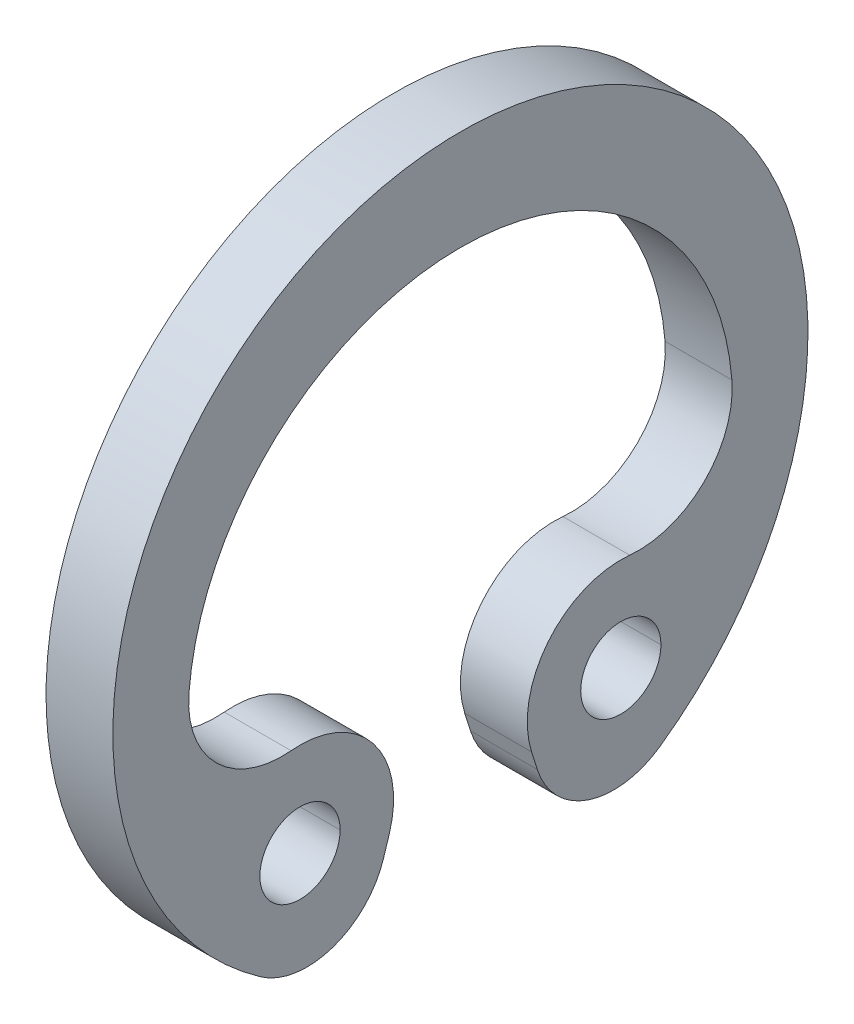
ISO-10303-21;
HEADER;
FILE_DESCRIPTION(('STEP AP214'),'2;1');
FILE_NAME('part.step','',(''),(''),'','','');
FILE_SCHEMA(('AUTOMOTIVE_DESIGN { 1 0 10303 214 1 1 1 1 }'));
ENDSEC;
DATA;
#1=APPLICATION_CONTEXT('core data for automotive mechanical design processes');
#2=APPLICATION_PROTOCOL_DEFINITION('international standard','automotive_design',2000,#1);
#3=PRODUCT_CONTEXT('',#1,'mechanical');
#4=PRODUCT('Part','Part','',(#3));
#5=PRODUCT_RELATED_PRODUCT_CATEGORY('part','',(#4));
#6=PRODUCT_DEFINITION_FORMATION('','',#4);
#7=PRODUCT_DEFINITION_CONTEXT('part definition',#1,'design');
#8=PRODUCT_DEFINITION('design','',#6,#7);
#9=PRODUCT_DEFINITION_SHAPE('','',#8);
#10=(LENGTH_UNIT() NAMED_UNIT(*) SI_UNIT(.MILLI.,.METRE.));
#11=(NAMED_UNIT(*) PLANE_ANGLE_UNIT() SI_UNIT($,.RADIAN.));
#12=(NAMED_UNIT(*) SI_UNIT($,.STERADIAN.) SOLID_ANGLE_UNIT());
#13=UNCERTAINTY_MEASURE_WITH_UNIT(LENGTH_MEASURE(1.E-05),#10,'distance_accuracy_value','');
#14=(GEOMETRIC_REPRESENTATION_CONTEXT(3) GLOBAL_UNCERTAINTY_ASSIGNED_CONTEXT((#13)) GLOBAL_UNIT_ASSIGNED_CONTEXT((#10,
#11,#12)) REPRESENTATION_CONTEXT('',''));
#15=CARTESIAN_POINT('',(0.,0.,0.));
#16=DIRECTION('',(0.,0.,1.));
#17=DIRECTION('',(1.,0.,0.));
#18=AXIS2_PLACEMENT_3D('',#15,#16,#17);
#19=CARTESIAN_POINT('',(0.5,-3.27636624130944,-2.29465122683329));
#20=DIRECTION('',(-1.,0.,0.));
#21=DIRECTION('',(0.,0.947082851566057,-0.320989208961151));
#22=AXIS2_PLACEMENT_3D('',#19,#20,#21);
#23=CYLINDRICAL_SURFACE('',#22,1.20000000000005);
#24=CARTESIAN_POINT('',(-0.5,-3.27636624130944,-2.29465122683329));
#25=DIRECTION('',(1.,0.,0.));
#26=DIRECTION('',(0.,0.,-1.));
#27=AXIS2_PLACEMENT_3D('',#24,#25,#26);
#28=CIRCLE('',#27,1.20000000000005);
#29=CARTESIAN_POINT('',(-0.5,-3.6381806072484,-1.150496357683));
#30=VERTEX_POINT('',#29);
#31=CARTESIAN_POINT('',(-0.5,-4.25927608667051,-2.98304663348009));
#32=VERTEX_POINT('',#31);
#33=EDGE_CURVE('E11',#30,#32,#28,.T.);
#34=ORIENTED_EDGE('',*,*,#33,.T.);
#35=DIRECTION('',(-1.,0.,0.));
#36=VECTOR('',#35,1.);
#37=CARTESIAN_POINT('',(0.5,-4.25927608667051,-2.98304663348009));
#38=LINE('',#37,#36);
#39=CARTESIAN_POINT('',(0.5,-4.25927608667051,-2.98304663348009));
#40=VERTEX_POINT('',#39);
#41=EDGE_CURVE('E25',#40,#32,#38,.T.);
#42=ORIENTED_EDGE('',*,*,#41,.F.);
#43=CARTESIAN_POINT('',(0.5,-3.27636624130944,-2.29465122683329));
#44=DIRECTION('',(1.,0.,0.));
#45=DIRECTION('',(0.,0.,-1.));
#46=AXIS2_PLACEMENT_3D('',#43,#44,#45);
#47=CIRCLE('',#46,1.20000000000005);
#48=CARTESIAN_POINT('',(0.5,-3.6381806072484,-1.150496357683));
#49=VERTEX_POINT('',#48);
#50=EDGE_CURVE('E301',#49,#40,#47,.T.);
#51=ORIENTED_EDGE('',*,*,#50,.F.);
#52=DIRECTION('',(-1.,0.,0.));
#53=VECTOR('',#52,1.);
#54=CARTESIAN_POINT('',(0.5,-3.6381806072484,-1.150496357683));
#55=LINE('',#54,#53);
#56=EDGE_CURVE('E297',#49,#30,#55,.T.);
#57=ORIENTED_EDGE('',*,*,#56,.T.);
#58=EDGE_LOOP('',(#34,#42,#51,#57));
#59=FACE_BOUND('',#58,.T.);
#60=ADVANCED_FACE('F17',(#59),#23,.T.);
#61=CARTESIAN_POINT('',(0.5,-3.3683007327933,-1.065152652658));
#62=DIRECTION('',(0.,0.301511971615848,-0.953462390958513));
#63=DIRECTION('',(0.,0.953462390958513,0.301511971615848));
#64=AXIS2_PLACEMENT_3D('',#61,#62,#63);
#65=PLANE('',#64);
#66=DIRECTION('',(0.,-0.953462390958513,-0.301511971615847));
#67=VECTOR('',#66,1.);
#68=CARTESIAN_POINT('',(-0.5,-3.3683007327933,-1.065152652658));
#69=LINE('',#68,#67);
#70=CARTESIAN_POINT('',(-0.5,-3.3683007327933,-1.065152652658));
#71=VERTEX_POINT('',#70);
#72=EDGE_CURVE('E292',#71,#30,#69,.T.);
#73=ORIENTED_EDGE('',*,*,#72,.T.);
#74=ORIENTED_EDGE('',*,*,#56,.F.);
#75=DIRECTION('',(0.,-0.953462390958513,-0.301511971615847));
#76=VECTOR('',#75,1.);
#77=CARTESIAN_POINT('',(0.5,-3.3683007327933,-1.065152652658));
#78=LINE('',#77,#76);
#79=CARTESIAN_POINT('',(0.5,-3.3683007327933,-1.065152652658));
#80=VERTEX_POINT('',#79);
#81=EDGE_CURVE('E287',#80,#49,#78,.T.);
#82=ORIENTED_EDGE('',*,*,#81,.F.);
#83=DIRECTION('',(-1.,0.,0.));
#84=VECTOR('',#83,1.);
#85=CARTESIAN_POINT('',(0.5,-3.3683007327933,-1.065152652658));
#86=LINE('',#85,#84);
#87=EDGE_CURVE('E283',#80,#71,#86,.T.);
#88=ORIENTED_EDGE('',*,*,#87,.T.);
#89=EDGE_LOOP('',(#73,#74,#82,#88));
#90=FACE_BOUND('',#89,.T.);
#91=ADVANCED_FACE('F318',(#90),#65,.F.);
#92=CARTESIAN_POINT('',(0.5,-2.94618397253134,-2.40000000000006));
#93=DIRECTION('',(-1.,0.,0.));
#94=DIRECTION('',(0.,-0.628697041238616,-0.777650326520738));
#95=AXIS2_PLACEMENT_3D('',#92,#93,#94);
#96=CYLINDRICAL_SURFACE('',#95,1.40000000000007);
#97=CARTESIAN_POINT('',(-0.5,-2.94618397253134,-2.40000000000006));
#98=DIRECTION('',(1.,0.,0.));
#99=DIRECTION('',(0.,0.,-1.));
#100=AXIS2_PLACEMENT_3D('',#97,#98,#99);
#101=CIRCLE('',#100,1.40000000000007);
#102=CARTESIAN_POINT('',(-0.5,-1.5525279459312,-2.5331273056939));
#103=VERTEX_POINT('',#102);
#104=EDGE_CURVE('E278',#103,#71,#101,.T.);
#105=ORIENTED_EDGE('',*,*,#104,.T.);
#106=ORIENTED_EDGE('',*,*,#87,.F.);
#107=CARTESIAN_POINT('',(0.5,-2.94618397253134,-2.40000000000006));
#108=DIRECTION('',(1.,0.,0.));
#109=DIRECTION('',(0.,0.,-1.));
#110=AXIS2_PLACEMENT_3D('',#107,#108,#109);
#111=CIRCLE('',#110,1.40000000000007);
#112=CARTESIAN_POINT('',(0.5,-1.5525279459312,-2.5331273056939));
#113=VERTEX_POINT('',#112);
#114=EDGE_CURVE('E273',#113,#80,#111,.T.);
#115=ORIENTED_EDGE('',*,*,#114,.F.);
#116=DIRECTION('',(-1.,0.,0.));
#117=VECTOR('',#116,1.);
#118=CARTESIAN_POINT('',(0.5,-1.5525279459312,-2.5331273056939));
#119=LINE('',#118,#117);
#120=EDGE_CURVE('E269',#113,#103,#119,.T.);
#121=ORIENTED_EDGE('',*,*,#120,.T.);
#122=EDGE_LOOP('',(#105,#106,#115,#121));
#123=FACE_BOUND('',#122,.T.);
#124=ADVANCED_FACE('F350',(#123),#96,.T.);
#125=CARTESIAN_POINT('',(0.5,-0.158871919331083,-2.66625461138772));
#126=DIRECTION('',(-1.,0.,0.));
#127=DIRECTION('',(0.,0.712162422773801,0.702014731746386));
#128=AXIS2_PLACEMENT_3D('',#125,#126,#127);
#129=CYLINDRICAL_SURFACE('',#128,1.40000000000004);
#130=CARTESIAN_POINT('',(-0.5,-0.158871919331083,-2.66625461138772));
#131=DIRECTION('',(1.,0.,0.));
#132=DIRECTION('',(0.,0.,-1.));
#133=AXIS2_PLACEMENT_3D('',#130,#131,#132);
#134=CIRCLE('',#133,1.40000000000004);
#135=CARTESIAN_POINT('',(-0.5,-0.0457581574857079,-4.061677585572));
#136=VERTEX_POINT('',#135);
#137=EDGE_CURVE('E264',#103,#136,#134,.T.);
#138=ORIENTED_EDGE('',*,*,#137,.F.);
#139=ORIENTED_EDGE('',*,*,#120,.F.);
#140=CARTESIAN_POINT('',(0.5,-0.158871919331083,-2.66625461138772));
#141=DIRECTION('',(1.,0.,0.));
#142=DIRECTION('',(0.,0.,-1.));
#143=AXIS2_PLACEMENT_3D('',#140,#141,#142);
#144=CIRCLE('',#143,1.40000000000004);
#145=CARTESIAN_POINT('',(0.5,-0.0457581574857079,-4.061677585572));
#146=VERTEX_POINT('',#145);
#147=EDGE_CURVE('E260',#113,#146,#144,.T.);
#148=ORIENTED_EDGE('',*,*,#147,.T.);
#149=DIRECTION('',(-1.,0.,0.));
#150=VECTOR('',#149,1.);
#151=CARTESIAN_POINT('',(0.5,-0.0457581574857079,-4.061677585572));
#152=LINE('',#151,#150);
#153=EDGE_CURVE('E256',#146,#136,#152,.T.);
#154=ORIENTED_EDGE('',*,*,#153,.T.);
#155=EDGE_LOOP('',(#138,#139,#148,#154));
#156=FACE_BOUND('',#155,.T.);
#157=ADVANCED_FACE('F347',(#156),#129,.F.);
#158=CARTESIAN_POINT('',(0.5,-0.375000000000027,0.));
#159=DIRECTION('',(-1.,0.,0.));
#160=DIRECTION('',(0.,-1.,0.));
#161=AXIS2_PLACEMENT_3D('',#158,#159,#160);
#162=CYLINDRICAL_SURFACE('',#161,4.075);
#163=CARTESIAN_POINT('',(-0.5,-0.375000000000027,0.));
#164=DIRECTION('',(1.,0.,0.));
#165=DIRECTION('',(0.,0.,-1.));
#166=AXIS2_PLACEMENT_3D('',#163,#164,#165);
#167=CIRCLE('',#166,4.075);
#168=CARTESIAN_POINT('',(-0.5,-0.0457581574857089,4.061677585572));
#169=VERTEX_POINT('',#168);
#170=EDGE_CURVE('E251',#136,#169,#167,.T.);
#171=ORIENTED_EDGE('',*,*,#170,.F.);
#172=ORIENTED_EDGE('',*,*,#153,.F.);
#173=CARTESIAN_POINT('',(0.5,-0.375000000000027,0.));
#174=DIRECTION('',(1.,0.,0.));
#175=DIRECTION('',(0.,0.,-1.));
#176=AXIS2_PLACEMENT_3D('',#173,#174,#175);
#177=CIRCLE('',#176,4.075);
#178=CARTESIAN_POINT('',(0.5,-0.0457581574857089,4.061677585572));
#179=VERTEX_POINT('',#178);
#180=EDGE_CURVE('E247',#146,#179,#177,.T.);
#181=ORIENTED_EDGE('',*,*,#180,.T.);
#182=DIRECTION('',(-1.,0.,0.));
#183=VECTOR('',#182,1.);
#184=CARTESIAN_POINT('',(0.5,-0.0457581574857089,4.061677585572));
#185=LINE('',#184,#183);
#186=EDGE_CURVE('E243',#179,#169,#185,.T.);
#187=ORIENTED_EDGE('',*,*,#186,.T.);
#188=EDGE_LOOP('',(#171,#172,#181,#187));
#189=FACE_BOUND('',#188,.T.);
#190=ADVANCED_FACE('F344',(#189),#162,.F.);
#191=CARTESIAN_POINT('',(0.5,-0.158871919331103,2.66625461138777));
#192=DIRECTION('',(-1.,0.,0.));
#193=DIRECTION('',(0.,0.712162413622486,-0.702014741029984));
#194=AXIS2_PLACEMENT_3D('',#191,#192,#193);
#195=CYLINDRICAL_SURFACE('',#194,1.4);
#196=CARTESIAN_POINT('',(-0.5,-0.158871919331103,2.66625461138777));
#197=DIRECTION('',(1.,0.,0.));
#198=DIRECTION('',(0.,0.,-1.));
#199=AXIS2_PLACEMENT_3D('',#196,#197,#198);
#200=CIRCLE('',#199,1.4);
#201=CARTESIAN_POINT('',(-0.5,-1.552527949402,2.5331273420287));
#202=VERTEX_POINT('',#201);
#203=EDGE_CURVE('E238',#169,#202,#200,.T.);
#204=ORIENTED_EDGE('',*,*,#203,.F.);
#205=ORIENTED_EDGE('',*,*,#186,.F.);
#206=CARTESIAN_POINT('',(0.5,-0.158871919331103,2.66625461138777));
#207=DIRECTION('',(1.,0.,0.));
#208=DIRECTION('',(0.,0.,-1.));
#209=AXIS2_PLACEMENT_3D('',#206,#207,#208);
#210=CIRCLE('',#209,1.4);
#211=CARTESIAN_POINT('',(0.5,-1.552527949402,2.5331273420287));
#212=VERTEX_POINT('',#211);
#213=EDGE_CURVE('E234',#179,#212,#210,.T.);
#214=ORIENTED_EDGE('',*,*,#213,.T.);
#215=DIRECTION('',(-1.,0.,0.));
#216=VECTOR('',#215,1.);
#217=CARTESIAN_POINT('',(0.5,-1.552527949402,2.5331273420287));
#218=LINE('',#217,#216);
#219=EDGE_CURVE('E230',#212,#202,#218,.T.);
#220=ORIENTED_EDGE('',*,*,#219,.T.);
#221=EDGE_LOOP('',(#204,#205,#214,#220));
#222=FACE_BOUND('',#221,.T.);
#223=ADVANCED_FACE('F337',(#222),#195,.F.);
#224=CARTESIAN_POINT('',(0.5,-2.94618397253135,2.40000000000011));
#225=DIRECTION('',(-1.,0.,0.));
#226=DIRECTION('',(0.,-0.628697051375902,0.777650318325175));
#227=AXIS2_PLACEMENT_3D('',#224,#225,#226);
#228=CYLINDRICAL_SURFACE('',#227,1.40000000000011);
#229=CARTESIAN_POINT('',(-0.5,-2.94618397253135,2.40000000000011));
#230=DIRECTION('',(1.,0.,0.));
#231=DIRECTION('',(0.,0.,-1.));
#232=AXIS2_PLACEMENT_3D('',#229,#230,#231);
#233=CIRCLE('',#232,1.40000000000011);
#234=CARTESIAN_POINT('',(-0.5,-3.3683007327933,1.065152652658));
#235=VERTEX_POINT('',#234);
#236=EDGE_CURVE('E225',#235,#202,#233,.T.);
#237=ORIENTED_EDGE('',*,*,#236,.T.);
#238=ORIENTED_EDGE('',*,*,#219,.F.);
#239=CARTESIAN_POINT('',(0.5,-2.94618397253135,2.40000000000011));
#240=DIRECTION('',(1.,0.,0.));
#241=DIRECTION('',(0.,0.,-1.));
#242=AXIS2_PLACEMENT_3D('',#239,#240,#241);
#243=CIRCLE('',#242,1.40000000000011);
#244=CARTESIAN_POINT('',(0.5,-3.3683007327933,1.065152652658));
#245=VERTEX_POINT('',#244);
#246=EDGE_CURVE('E220',#245,#212,#243,.T.);
#247=ORIENTED_EDGE('',*,*,#246,.F.);
#248=DIRECTION('',(-1.,0.,0.));
#249=VECTOR('',#248,1.);
#250=CARTESIAN_POINT('',(0.5,-3.3683007327933,1.065152652658));
#251=LINE('',#250,#249);
#252=EDGE_CURVE('E216',#245,#235,#251,.T.);
#253=ORIENTED_EDGE('',*,*,#252,.T.);
#254=EDGE_LOOP('',(#237,#238,#247,#253));
#255=FACE_BOUND('',#254,.T.);
#256=ADVANCED_FACE('F334',(#255),#228,.T.);
#257=CARTESIAN_POINT('',(0.5,-3.6381806072484,1.150496357683));
#258=DIRECTION('',(0.,0.301511971615848,0.953462390958513));
#259=DIRECTION('',(0.,-0.953462390958513,0.301511971615848));
#260=AXIS2_PLACEMENT_3D('',#257,#258,#259);
#261=PLANE('',#260);
#262=DIRECTION('',(0.,0.953462390958513,-0.301511971615847));
#263=VECTOR('',#262,1.);
#264=CARTESIAN_POINT('',(-0.5,-3.6381806072484,1.150496357683));
#265=LINE('',#264,#263);
#266=CARTESIAN_POINT('',(-0.5,-3.6381806072484,1.150496357683));
#267=VERTEX_POINT('',#266);
#268=EDGE_CURVE('E211',#267,#235,#265,.T.);
#269=ORIENTED_EDGE('',*,*,#268,.T.);
#270=ORIENTED_EDGE('',*,*,#252,.F.);
#271=DIRECTION('',(0.,0.953462390958513,-0.301511971615847));
#272=VECTOR('',#271,1.);
#273=CARTESIAN_POINT('',(0.5,-3.6381806072484,1.150496357683));
#274=LINE('',#273,#272);
#275=CARTESIAN_POINT('',(0.5,-3.6381806072484,1.150496357683));
#276=VERTEX_POINT('',#275);
#277=EDGE_CURVE('E206',#276,#245,#274,.T.);
#278=ORIENTED_EDGE('',*,*,#277,.F.);
#279=DIRECTION('',(-1.,0.,0.));
#280=VECTOR('',#279,1.);
#281=CARTESIAN_POINT('',(0.5,-3.6381806072484,1.150496357683));
#282=LINE('',#281,#280);
#283=EDGE_CURVE('E202',#276,#267,#282,.T.);
#284=ORIENTED_EDGE('',*,*,#283,.T.);
#285=EDGE_LOOP('',(#269,#270,#278,#284));
#286=FACE_BOUND('',#285,.T.);
#287=ADVANCED_FACE('F332',(#286),#261,.F.);
#288=CARTESIAN_POINT('',(0.5,-3.27636624130945,2.29465122683329));
#289=DIRECTION('',(-1.,0.,0.));
#290=DIRECTION('',(0.,0.947082845263758,0.320989227556167));
#291=AXIS2_PLACEMENT_3D('',#288,#289,#290);
#292=CYLINDRICAL_SURFACE('',#291,1.20000000000004);
#293=CARTESIAN_POINT('',(-0.5,-3.27636624130945,2.29465122683329));
#294=DIRECTION('',(1.,0.,0.));
#295=DIRECTION('',(0.,0.,-1.));
#296=AXIS2_PLACEMENT_3D('',#293,#294,#295);
#297=CIRCLE('',#296,1.20000000000004);
#298=CARTESIAN_POINT('',(-0.5,-4.25927611370239,2.9830465948832));
#299=VERTEX_POINT('',#298);
#300=EDGE_CURVE('E197',#299,#267,#297,.T.);
#301=ORIENTED_EDGE('',*,*,#300,.T.);
#302=ORIENTED_EDGE('',*,*,#283,.F.);
#303=CARTESIAN_POINT('',(0.5,-3.27636624130945,2.29465122683329));
#304=DIRECTION('',(1.,0.,0.));
#305=DIRECTION('',(0.,0.,-1.));
#306=AXIS2_PLACEMENT_3D('',#303,#304,#305);
#307=CIRCLE('',#306,1.20000000000004);
#308=CARTESIAN_POINT('',(0.5,-4.25927611370239,2.9830465948832));
#309=VERTEX_POINT('',#308);
#310=EDGE_CURVE('E192',#309,#276,#307,.T.);
#311=ORIENTED_EDGE('',*,*,#310,.F.);
#312=DIRECTION('',(-1.,0.,0.));
#313=VECTOR('',#312,1.);
#314=CARTESIAN_POINT('',(0.5,-4.25927611370239,2.9830465948832));
#315=LINE('',#314,#313);
#316=EDGE_CURVE('E188',#309,#299,#315,.T.);
#317=ORIENTED_EDGE('',*,*,#316,.T.);
#318=EDGE_LOOP('',(#301,#302,#311,#317));
#319=FACE_BOUND('',#318,.T.);
#320=ADVANCED_FACE('F327',(#319),#292,.T.);
#321=CARTESIAN_POINT('',(0.5,0.,0.));
#322=DIRECTION('',(-1.,0.,0.));
#323=DIRECTION('',(0.,-1.,-4.53091935620133E-09));
#324=AXIS2_PLACEMENT_3D('',#321,#322,#323);
#325=CYLINDRICAL_SURFACE('',#324,5.2);
#326=CARTESIAN_POINT('',(-0.5,0.,0.));
#327=DIRECTION('',(1.,0.,0.));
#328=DIRECTION('',(0.,0.,-1.));
#329=AXIS2_PLACEMENT_3D('',#326,#327,#328);
#330=CIRCLE('',#329,5.2);
#331=EDGE_CURVE('E183',#32,#299,#330,.T.);
#332=ORIENTED_EDGE('',*,*,#331,.T.);
#333=ORIENTED_EDGE('',*,*,#316,.F.);
#334=CARTESIAN_POINT('',(0.5,0.,0.));
#335=DIRECTION('',(1.,0.,0.));
#336=DIRECTION('',(0.,0.,-1.));
#337=AXIS2_PLACEMENT_3D('',#334,#335,#336);
#338=CIRCLE('',#337,5.2);
#339=EDGE_CURVE('E178',#40,#309,#338,.T.);
#340=ORIENTED_EDGE('',*,*,#339,.F.);
#341=ORIENTED_EDGE('',*,*,#41,.T.);
#342=EDGE_LOOP('',(#332,#333,#340,#341));
#343=FACE_BOUND('',#342,.T.);
#344=ADVANCED_FACE('F311',(#343),#325,.T.);
#345=CARTESIAN_POINT('',(0.5,-3.27636624130944,-2.29465122683329));
#346=DIRECTION('',(1.,0.,0.));
#347=DIRECTION('',(0.,0.,-1.));
#348=AXIS2_PLACEMENT_3D('',#345,#346,#347);
#349=PLANE('',#348);
#350=CARTESIAN_POINT('',(0.5,-2.9461839725312,2.4));
#351=DIRECTION('',(1.,0.,0.));
#352=DIRECTION('',(0.,0.,-1.));
#353=AXIS2_PLACEMENT_3D('',#350,#351,#352);
#354=CIRCLE('',#353,0.6);
#355=CARTESIAN_POINT('',(0.5,-2.9461839725312,3.));
#356=VERTEX_POINT('',#355);
#357=CARTESIAN_POINT('',(0.5,-2.9461839725312,1.8));
#358=VERTEX_POINT('',#357);
#359=EDGE_CURVE('E134',#356,#358,#354,.T.);
#360=ORIENTED_EDGE('',*,*,#359,.F.);
#361=CARTESIAN_POINT('',(0.5,-2.9461839725312,2.4));
#362=DIRECTION('',(1.,0.,0.));
#363=DIRECTION('',(0.,0.,-1.));
#364=AXIS2_PLACEMENT_3D('',#361,#362,#363);
#365=CIRCLE('',#364,0.6);
#366=EDGE_CURVE('E171',#358,#356,#365,.T.);
#367=ORIENTED_EDGE('',*,*,#366,.F.);
#368=EDGE_LOOP('',(#360,#367));
#369=FACE_BOUND('',#368,.T.);
#370=CARTESIAN_POINT('',(0.5,-2.9461839725312,-2.4));
#371=DIRECTION('',(1.,0.,0.));
#372=DIRECTION('',(0.,0.,-1.));
#373=AXIS2_PLACEMENT_3D('',#370,#371,#372);
#374=CIRCLE('',#373,0.6);
#375=CARTESIAN_POINT('',(0.5,-2.9461839725312,-1.8));
#376=VERTEX_POINT('',#375);
#377=CARTESIAN_POINT('',(0.5,-2.9461839725312,-3.));
#378=VERTEX_POINT('',#377);
#379=EDGE_CURVE('E166',#376,#378,#374,.T.);
#380=ORIENTED_EDGE('',*,*,#379,.F.);
#381=CARTESIAN_POINT('',(0.5,-2.9461839725312,-2.4));
#382=DIRECTION('',(1.,0.,0.));
#383=DIRECTION('',(0.,0.,-1.));
#384=AXIS2_PLACEMENT_3D('',#381,#382,#383);
#385=CIRCLE('',#384,0.6);
#386=EDGE_CURVE('E161',#378,#376,#385,.T.);
#387=ORIENTED_EDGE('',*,*,#386,.F.);
#388=EDGE_LOOP('',(#380,#387));
#389=FACE_BOUND('',#388,.T.);
#390=ORIENTED_EDGE('',*,*,#50,.T.);
#391=ORIENTED_EDGE('',*,*,#339,.T.);
#392=ORIENTED_EDGE('',*,*,#310,.T.);
#393=ORIENTED_EDGE('',*,*,#277,.T.);
#394=ORIENTED_EDGE('',*,*,#246,.T.);
#395=ORIENTED_EDGE('',*,*,#213,.F.);
#396=ORIENTED_EDGE('',*,*,#180,.F.);
#397=ORIENTED_EDGE('',*,*,#147,.F.);
#398=ORIENTED_EDGE('',*,*,#114,.T.);
#399=ORIENTED_EDGE('',*,*,#81,.T.);
#400=EDGE_LOOP('',(#390,#391,#392,#393,#394,#395,#396,#397,#398,#399));
#401=FACE_BOUND('',#400,.T.);
#402=ADVANCED_FACE('F315',(#369,#389,#401),#349,.T.);
#403=CARTESIAN_POINT('',(0.5,-2.9461839725312,-2.4));
#404=DIRECTION('',(-1.,0.,0.));
#405=DIRECTION('',(0.,-1.,0.));
#406=AXIS2_PLACEMENT_3D('',#403,#404,#405);
#407=CYLINDRICAL_SURFACE('',#406,0.6);
#408=DIRECTION('',(-1.,0.,0.));
#409=VECTOR('',#408,1.);
#410=CARTESIAN_POINT('',(0.5,-2.9461839725312,-3.));
#411=LINE('',#410,#409);
#412=CARTESIAN_POINT('',(-0.5,-2.9461839725312,-3.));
#413=VERTEX_POINT('',#412);
#414=EDGE_CURVE('E156',#378,#413,#411,.T.);
#415=ORIENTED_EDGE('',*,*,#414,.F.);
#416=ORIENTED_EDGE('',*,*,#386,.T.);
#417=DIRECTION('',(-1.,0.,0.));
#418=VECTOR('',#417,1.);
#419=CARTESIAN_POINT('',(0.5,-2.9461839725312,-1.8));
#420=LINE('',#419,#418);
#421=CARTESIAN_POINT('',(-0.5,-2.9461839725312,-1.8));
#422=VERTEX_POINT('',#421);
#423=EDGE_CURVE('E152',#376,#422,#420,.T.);
#424=ORIENTED_EDGE('',*,*,#423,.T.);
#425=CARTESIAN_POINT('',(-0.5,-2.9461839725312,-2.4));
#426=DIRECTION('',(1.,0.,0.));
#427=DIRECTION('',(0.,0.,-1.));
#428=AXIS2_PLACEMENT_3D('',#425,#426,#427);
#429=CIRCLE('',#428,0.6);
#430=EDGE_CURVE('E131',#413,#422,#429,.T.);
#431=ORIENTED_EDGE('',*,*,#430,.F.);
#432=EDGE_LOOP('',(#415,#416,#424,#431));
#433=FACE_BOUND('',#432,.T.);
#434=ADVANCED_FACE('F447',(#433),#407,.F.);
#435=CARTESIAN_POINT('',(-0.5,-3.27636624130944,-2.29465122683329));
#436=DIRECTION('',(1.,0.,0.));
#437=DIRECTION('',(0.,0.,-1.));
#438=AXIS2_PLACEMENT_3D('',#435,#436,#437);
#439=PLANE('',#438);
#440=CARTESIAN_POINT('',(-0.5,-2.9461839725312,2.4));
#441=DIRECTION('',(1.,0.,0.));
#442=DIRECTION('',(0.,0.,-1.));
#443=AXIS2_PLACEMENT_3D('',#440,#441,#442);
#444=CIRCLE('',#443,0.6);
#445=CARTESIAN_POINT('',(-0.5,-2.9461839725312,1.8));
#446=VERTEX_POINT('',#445);
#447=CARTESIAN_POINT('',(-0.5,-2.9461839725312,3.));
#448=VERTEX_POINT('',#447);
#449=EDGE_CURVE('E117',#446,#448,#444,.T.);
#450=ORIENTED_EDGE('',*,*,#449,.T.);
#451=CARTESIAN_POINT('',(-0.5,-2.9461839725312,2.4));
#452=DIRECTION('',(1.,0.,0.));
#453=DIRECTION('',(0.,0.,-1.));
#454=AXIS2_PLACEMENT_3D('',#451,#452,#453);
#455=CIRCLE('',#454,0.6);
#456=EDGE_CURVE('E113',#448,#446,#455,.T.);
#457=ORIENTED_EDGE('',*,*,#456,.T.);
#458=EDGE_LOOP('',(#450,#457));
#459=FACE_BOUND('',#458,.T.);
#460=ORIENTED_EDGE('',*,*,#430,.T.);
#461=CARTESIAN_POINT('',(-0.5,-2.9461839725312,-2.4));
#462=DIRECTION('',(1.,0.,0.));
#463=DIRECTION('',(0.,0.,-1.));
#464=AXIS2_PLACEMENT_3D('',#461,#462,#463);
#465=CIRCLE('',#464,0.6);
#466=EDGE_CURVE('E122',#422,#413,#465,.T.);
#467=ORIENTED_EDGE('',*,*,#466,.T.);
#468=EDGE_LOOP('',(#460,#467));
#469=FACE_BOUND('',#468,.T.);
#470=ORIENTED_EDGE('',*,*,#33,.F.);
#471=ORIENTED_EDGE('',*,*,#72,.F.);
#472=ORIENTED_EDGE('',*,*,#104,.F.);
#473=ORIENTED_EDGE('',*,*,#137,.T.);
#474=ORIENTED_EDGE('',*,*,#170,.T.);
#475=ORIENTED_EDGE('',*,*,#203,.T.);
#476=ORIENTED_EDGE('',*,*,#236,.F.);
#477=ORIENTED_EDGE('',*,*,#268,.F.);
#478=ORIENTED_EDGE('',*,*,#300,.F.);
#479=ORIENTED_EDGE('',*,*,#331,.F.);
#480=EDGE_LOOP('',(#470,#471,#472,#473,#474,#475,#476,#477,#478,#479));
#481=FACE_BOUND('',#480,.T.);
#482=ADVANCED_FACE('F115',(#459,#469,#481),#439,.F.);
#483=CARTESIAN_POINT('',(0.5,-2.9461839725312,-2.4));
#484=DIRECTION('',(-1.,0.,0.));
#485=DIRECTION('',(0.,1.,0.));
#486=AXIS2_PLACEMENT_3D('',#483,#484,#485);
#487=CYLINDRICAL_SURFACE('',#486,0.6);
#488=ORIENTED_EDGE('',*,*,#414,.T.);
#489=ORIENTED_EDGE('',*,*,#466,.F.);
#490=ORIENTED_EDGE('',*,*,#423,.F.);
#491=ORIENTED_EDGE('',*,*,#379,.T.);
#492=EDGE_LOOP('',(#488,#489,#490,#491));
#493=FACE_BOUND('',#492,.T.);
#494=ADVANCED_FACE('F468',(#493),#487,.F.);
#495=CARTESIAN_POINT('',(0.5,-2.9461839725312,2.4));
#496=DIRECTION('',(-1.,0.,0.));
#497=DIRECTION('',(0.,1.,0.));
#498=AXIS2_PLACEMENT_3D('',#495,#496,#497);
#499=CYLINDRICAL_SURFACE('',#498,0.6);
#500=DIRECTION('',(-1.,0.,0.));
#501=VECTOR('',#500,1.);
#502=CARTESIAN_POINT('',(0.5,-2.9461839725312,1.8));
#503=LINE('',#502,#501);
#504=EDGE_CURVE('E128',#358,#446,#503,.T.);
#505=ORIENTED_EDGE('',*,*,#504,.T.);
#506=ORIENTED_EDGE('',*,*,#456,.F.);
#507=DIRECTION('',(-1.,0.,0.));
#508=VECTOR('',#507,1.);
#509=CARTESIAN_POINT('',(0.5,-2.9461839725312,3.));
#510=LINE('',#509,#508);
#511=EDGE_CURVE('E130',#356,#448,#510,.T.);
#512=ORIENTED_EDGE('',*,*,#511,.F.);
#513=ORIENTED_EDGE('',*,*,#359,.T.);
#514=EDGE_LOOP('',(#505,#506,#512,#513));
#515=FACE_BOUND('',#514,.T.);
#516=ADVANCED_FACE('F133',(#515),#499,.F.);
#517=CARTESIAN_POINT('',(0.5,-2.9461839725312,2.4));
#518=DIRECTION('',(-1.,0.,0.));
#519=DIRECTION('',(0.,-1.,0.));
#520=AXIS2_PLACEMENT_3D('',#517,#518,#519);
#521=CYLINDRICAL_SURFACE('',#520,0.6);
#522=ORIENTED_EDGE('',*,*,#504,.F.);
#523=ORIENTED_EDGE('',*,*,#366,.T.);
#524=ORIENTED_EDGE('',*,*,#511,.T.);
#525=ORIENTED_EDGE('',*,*,#449,.F.);
#526=EDGE_LOOP('',(#522,#523,#524,#525));
#527=FACE_BOUND('',#526,.T.);
#528=ADVANCED_FACE('F126',(#527),#521,.F.);
#529=CLOSED_SHELL('',(#60,#91,#124,#157,#190,#223,#256,#287,#320,#344,#402,#434,#482,#494,#516,#528));
#530=MANIFOLD_SOLID_BREP('B1',#529);
#531=ADVANCED_BREP_SHAPE_REPRESENTATION('',(#18,#530),#14);
#532=SHAPE_DEFINITION_REPRESENTATION(#9,#531);
ENDSEC;
END-ISO-10303-21;
